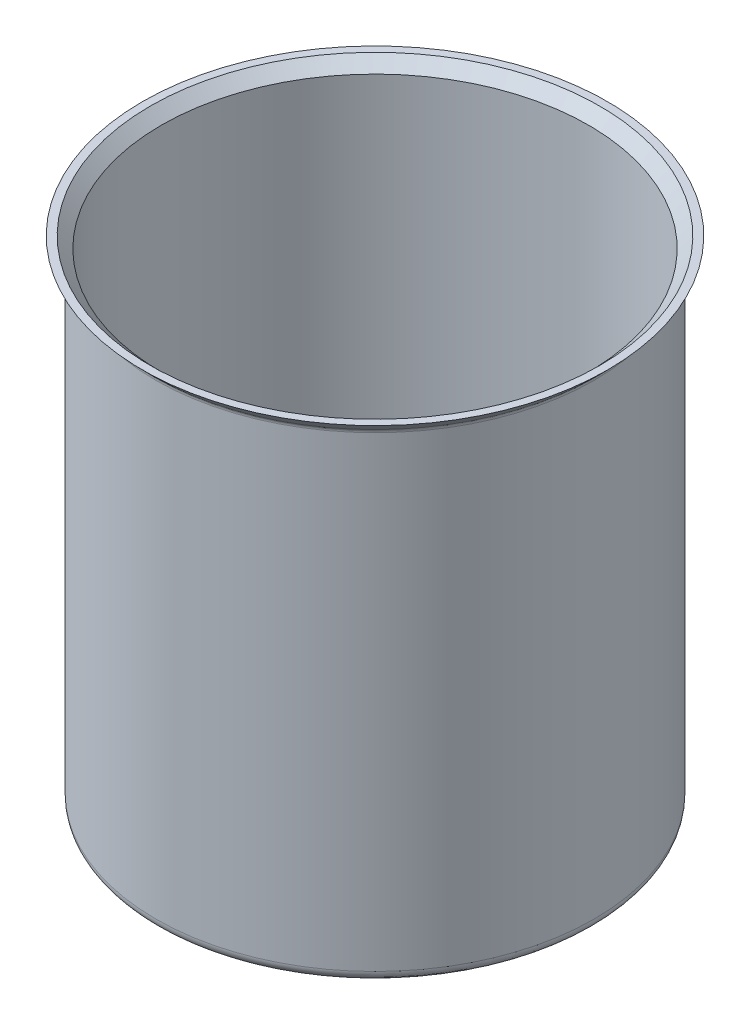
ISO-10303-21;
HEADER;
FILE_DESCRIPTION(('STEP AP214'),'2;1');
FILE_NAME('part.step','',(''),(''),'','','');
FILE_SCHEMA(('AUTOMOTIVE_DESIGN { 1 0 10303 214 1 1 1 1 }'));
ENDSEC;
DATA;
#1=APPLICATION_CONTEXT('core data for automotive mechanical design processes');
#2=APPLICATION_PROTOCOL_DEFINITION('international standard','automotive_design',2000,#1);
#3=PRODUCT_CONTEXT('',#1,'mechanical');
#4=PRODUCT('Part','Part','',(#3));
#5=PRODUCT_RELATED_PRODUCT_CATEGORY('part','',(#4));
#6=PRODUCT_DEFINITION_FORMATION('','',#4);
#7=PRODUCT_DEFINITION_CONTEXT('part definition',#1,'design');
#8=PRODUCT_DEFINITION('design','',#6,#7);
#9=PRODUCT_DEFINITION_SHAPE('','',#8);
#10=(LENGTH_UNIT() NAMED_UNIT(*) SI_UNIT(.MILLI.,.METRE.));
#11=(NAMED_UNIT(*) PLANE_ANGLE_UNIT() SI_UNIT($,.RADIAN.));
#12=(NAMED_UNIT(*) SI_UNIT($,.STERADIAN.) SOLID_ANGLE_UNIT());
#13=UNCERTAINTY_MEASURE_WITH_UNIT(LENGTH_MEASURE(1.E-05),#10,'distance_accuracy_value','');
#14=(GEOMETRIC_REPRESENTATION_CONTEXT(3) GLOBAL_UNCERTAINTY_ASSIGNED_CONTEXT((#13)) GLOBAL_UNIT_ASSIGNED_CONTEXT((#10,
#11,#12)) REPRESENTATION_CONTEXT('',''));
#15=CARTESIAN_POINT('',(0.,0.,0.));
#16=DIRECTION('',(0.,0.,1.));
#17=DIRECTION('',(1.,0.,0.));
#18=AXIS2_PLACEMENT_3D('',#15,#16,#17);
#19=CARTESIAN_POINT('',(42.4311474666086,51.3579902321066,0.));
#20=DIRECTION('',(0.,-1.,0.));
#21=DIRECTION('',(1.,0.,0.));
#22=AXIS2_PLACEMENT_3D('',#19,#20,#21);
#23=PLANE('',#22);
#24=CARTESIAN_POINT('',(0.,51.3579902321065,0.));
#25=DIRECTION('',(0.,1.,0.));
#26=DIRECTION('',(-1.,0.,0.));
#27=AXIS2_PLACEMENT_3D('',#24,#25,#26);
#28=CIRCLE('',#27,42.4311474666086);
#29=CARTESIAN_POINT('',(-42.4311474666086,51.3579902321065,0.));
#30=VERTEX_POINT('',#29);
#31=EDGE_CURVE('E51',#30,#30,#28,.T.);
#32=ORIENTED_EDGE('',*,*,#31,.T.);
#33=EDGE_LOOP('',(#32));
#34=FACE_BOUND('',#33,.T.);
#35=CARTESIAN_POINT('',(0.,51.3579902321065,0.));
#36=DIRECTION('',(0.,-1.,0.));
#37=DIRECTION('',(1.,0.,0.));
#38=AXIS2_PLACEMENT_3D('',#35,#36,#37);
#39=CIRCLE('',#38,41.0169339042355);
#40=CARTESIAN_POINT('',(41.0169339042355,51.3579902321066,0.));
#41=VERTEX_POINT('',#40);
#42=EDGE_CURVE('E55',#41,#41,#39,.F.);
#43=ORIENTED_EDGE('',*,*,#42,.F.);
#44=EDGE_LOOP('',(#43));
#45=FACE_BOUND('',#44,.T.);
#46=ADVANCED_FACE('F31',(#34,#45),#23,.F.);
#47=CARTESIAN_POINT('',(0.,-38.6420097678935,0.));
#48=DIRECTION('',(0.,1.,0.));
#49=DIRECTION('',(-1.,0.,0.));
#50=AXIS2_PLACEMENT_3D('',#47,#48,#49);
#51=PLANE('',#50);
#52=CARTESIAN_POINT('',(0.,-38.6420097678935,0.));
#53=DIRECTION('',(0.,1.,0.));
#54=DIRECTION('',(-1.,0.,0.));
#55=AXIS2_PLACEMENT_3D('',#52,#53,#54);
#56=CIRCLE('',#55,38.);
#57=CARTESIAN_POINT('',(-38.,-38.6420097678935,0.));
#58=VERTEX_POINT('',#57);
#59=EDGE_CURVE('E42',#58,#58,#56,.F.);
#60=ORIENTED_EDGE('',*,*,#59,.T.);
#61=EDGE_LOOP('',(#60));
#62=FACE_BOUND('',#61,.T.);
#63=ADVANCED_FACE('F81',(#62),#51,.F.);
#64=CARTESIAN_POINT('',(0.,51.3579902321066,0.));
#65=DIRECTION('',(0.,1.,0.));
#66=DIRECTION('',(-1.,0.,0.));
#67=AXIS2_PLACEMENT_3D('',#64,#65,#66);
#68=CYLINDRICAL_SURFACE('',#67,40.);
#69=CARTESIAN_POINT('',(0.,48.5126292031249,0.));
#70=DIRECTION('',(0.,1.,0.));
#71=DIRECTION('',(-1.,0.,0.));
#72=AXIS2_PLACEMENT_3D('',#69,#70,#71);
#73=CIRCLE('',#72,40.);
#74=CARTESIAN_POINT('',(-40.,48.5126292031249,0.));
#75=VERTEX_POINT('',#74);
#76=EDGE_CURVE('E10',#75,#75,#73,.F.);
#77=ORIENTED_EDGE('',*,*,#76,.T.);
#78=EDGE_LOOP('',(#77));
#79=FACE_BOUND('',#78,.T.);
#80=CARTESIAN_POINT('',(0.,-36.6420097678935,0.));
#81=DIRECTION('',(0.,1.,0.));
#82=DIRECTION('',(-1.,0.,0.));
#83=AXIS2_PLACEMENT_3D('',#80,#81,#82);
#84=CIRCLE('',#83,40.);
#85=CARTESIAN_POINT('',(-40.,-36.6420097678935,0.));
#86=VERTEX_POINT('',#85);
#87=EDGE_CURVE('E46',#86,#86,#84,.T.);
#88=ORIENTED_EDGE('',*,*,#87,.T.);
#89=EDGE_LOOP('',(#88));
#90=FACE_BOUND('',#89,.T.);
#91=ADVANCED_FACE('F87',(#79,#90),#68,.T.);
#92=CARTESIAN_POINT('',(0.,48.926842765498,0.));
#93=DIRECTION('',(0.,1.,0.));
#94=DIRECTION('',(-1.,0.,0.));
#95=AXIS2_PLACEMENT_3D('',#92,#93,#94);
#96=CONICAL_SURFACE('',#95,40.,0.785398163397448);
#97=CARTESIAN_POINT('',(0.,49.2197359843114,0.));
#98=DIRECTION('',(0.,1.,0.));
#99=DIRECTION('',(-1.,0.,0.));
#100=AXIS2_PLACEMENT_3D('',#97,#98,#99);
#101=CIRCLE('',#100,40.2928932188135);
#102=CARTESIAN_POINT('',(-40.2928932188135,49.2197359843114,0.));
#103=VERTEX_POINT('',#102);
#104=EDGE_CURVE('E38',#103,#103,#101,.T.);
#105=ORIENTED_EDGE('',*,*,#104,.T.);
#106=EDGE_LOOP('',(#105));
#107=FACE_BOUND('',#106,.T.);
#108=ORIENTED_EDGE('',*,*,#31,.F.);
#109=EDGE_LOOP('',(#108));
#110=FACE_BOUND('',#109,.T.);
#111=ADVANCED_FACE('F78',(#107,#110),#96,.T.);
#112=CARTESIAN_POINT('',(0.,-37.6420097678935,0.));
#113=DIRECTION('',(0.,1.,0.));
#114=DIRECTION('',(-1.,0.,0.));
#115=AXIS2_PLACEMENT_3D('',#112,#113,#114);
#116=PLANE('',#115);
#117=CARTESIAN_POINT('',(0.,-37.6420097678935,0.));
#118=DIRECTION('',(0.,1.,0.));
#119=DIRECTION('',(-1.,0.,0.));
#120=AXIS2_PLACEMENT_3D('',#117,#118,#119);
#121=CIRCLE('',#120,39.);
#122=CARTESIAN_POINT('',(-39.,-37.6420097678935,0.));
#123=VERTEX_POINT('',#122);
#124=EDGE_CURVE('E54',#123,#123,#121,.T.);
#125=ORIENTED_EDGE('',*,*,#124,.T.);
#126=EDGE_LOOP('',(#125));
#127=FACE_BOUND('',#126,.T.);
#128=ADVANCED_FACE('F64',(#127),#116,.T.);
#129=CARTESIAN_POINT('',(0.,51.3579902321066,0.));
#130=DIRECTION('',(0.,1.,0.));
#131=DIRECTION('',(-1.,0.,0.));
#132=AXIS2_PLACEMENT_3D('',#129,#130,#131);
#133=CYLINDRICAL_SURFACE('',#132,39.);
#134=CARTESIAN_POINT('',(0.,49.341056327871,0.));
#135=DIRECTION('',(0.,1.,0.));
#136=DIRECTION('',(-1.,0.,0.));
#137=AXIS2_PLACEMENT_3D('',#134,#135,#136);
#138=CIRCLE('',#137,39.);
#139=CARTESIAN_POINT('',(-39.,49.341056327871,0.));
#140=VERTEX_POINT('',#139);
#141=EDGE_CURVE('E58',#140,#140,#138,.T.);
#142=ORIENTED_EDGE('',*,*,#141,.T.);
#143=EDGE_LOOP('',(#142));
#144=FACE_BOUND('',#143,.T.);
#145=ORIENTED_EDGE('',*,*,#124,.F.);
#146=EDGE_LOOP('',(#145));
#147=FACE_BOUND('',#146,.T.);
#148=ADVANCED_FACE('F66',(#144,#147),#133,.F.);
#149=CARTESIAN_POINT('',(0.,49.6339495466845,0.));
#150=DIRECTION('',(0.,1.,0.));
#151=DIRECTION('',(-1.,0.,0.));
#152=AXIS2_PLACEMENT_3D('',#149,#150,#151);
#153=CONICAL_SURFACE('',#152,39.2928932188135,0.785398163397448);
#154=ORIENTED_EDGE('',*,*,#42,.T.);
#155=EDGE_LOOP('',(#154));
#156=FACE_BOUND('',#155,.T.);
#157=ORIENTED_EDGE('',*,*,#141,.F.);
#158=EDGE_LOOP('',(#157));
#159=FACE_BOUND('',#158,.T.);
#160=ADVANCED_FACE('F68',(#156,#159),#153,.F.);
#161=CARTESIAN_POINT('',(0.,-36.6420097678935,0.));
#162=DIRECTION('',(0.,1.,0.));
#163=DIRECTION('',(-1.,0.,0.));
#164=AXIS2_PLACEMENT_3D('',#161,#162,#163);
#165=TOROIDAL_SURFACE('',#164,38.,2.);
#166=ORIENTED_EDGE('',*,*,#59,.F.);
#167=EDGE_LOOP('',(#166));
#168=FACE_BOUND('',#167,.T.);
#169=ORIENTED_EDGE('',*,*,#87,.F.);
#170=EDGE_LOOP('',(#169));
#171=FACE_BOUND('',#170,.T.);
#172=ADVANCED_FACE('F75',(#168,#171),#165,.T.);
#173=CARTESIAN_POINT('',(0.,48.5126292031249,0.));
#174=DIRECTION('',(0.,1.,0.));
#175=DIRECTION('',(-1.,0.,0.));
#176=AXIS2_PLACEMENT_3D('',#173,#174,#175);
#177=TOROIDAL_SURFACE('',#176,41.,1.);
#178=ORIENTED_EDGE('',*,*,#76,.F.);
#179=EDGE_LOOP('',(#178));
#180=FACE_BOUND('',#179,.T.);
#181=ORIENTED_EDGE('',*,*,#104,.F.);
#182=EDGE_LOOP('',(#181));
#183=FACE_BOUND('',#182,.T.);
#184=ADVANCED_FACE('F33',(#180,#183),#177,.F.);
#185=CLOSED_SHELL('',(#46,#63,#91,#111,#128,#148,#160,#172,#184));
#186=MANIFOLD_SOLID_BREP('B2',#185);
#187=ADVANCED_BREP_SHAPE_REPRESENTATION('',(#18,#186),#14);
#188=SHAPE_DEFINITION_REPRESENTATION(#9,#187);
ENDSEC;
END-ISO-10303-21;
